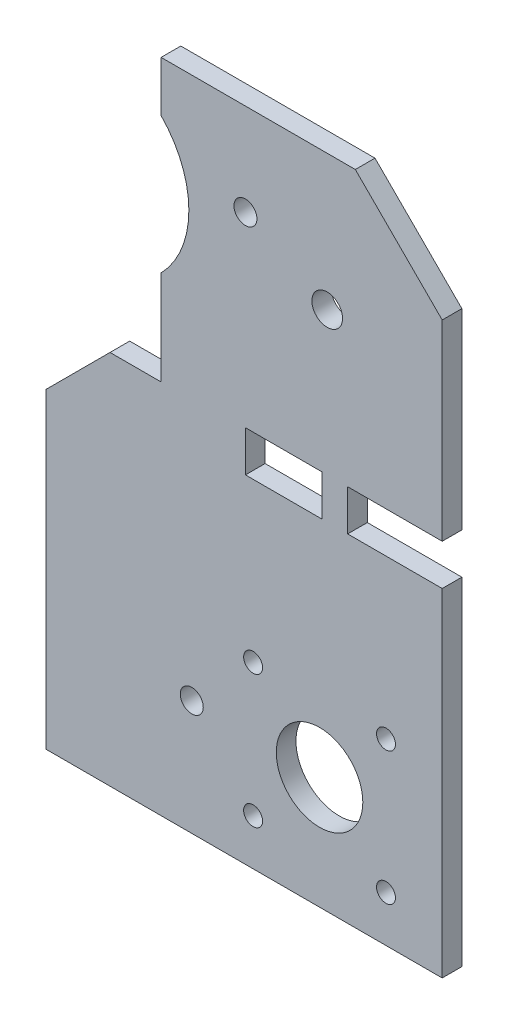
ISO-10303-21;
HEADER;
FILE_DESCRIPTION(('STEP AP214'),'2;1');
FILE_NAME('part.step','',(''),(''),'','','');
FILE_SCHEMA(('AUTOMOTIVE_DESIGN { 1 0 10303 214 1 1 1 1 }'));
ENDSEC;
DATA;
#1=APPLICATION_CONTEXT('core data for automotive mechanical design processes');
#2=APPLICATION_PROTOCOL_DEFINITION('international standard','automotive_design',2000,#1);
#3=PRODUCT_CONTEXT('',#1,'mechanical');
#4=PRODUCT('Part','Part','',(#3));
#5=PRODUCT_RELATED_PRODUCT_CATEGORY('part','',(#4));
#6=PRODUCT_DEFINITION_FORMATION('','',#4);
#7=PRODUCT_DEFINITION_CONTEXT('part definition',#1,'design');
#8=PRODUCT_DEFINITION('design','',#6,#7);
#9=PRODUCT_DEFINITION_SHAPE('','',#8);
#10=(LENGTH_UNIT() NAMED_UNIT(*) SI_UNIT(.MILLI.,.METRE.));
#11=(NAMED_UNIT(*) PLANE_ANGLE_UNIT() SI_UNIT($,.RADIAN.));
#12=(NAMED_UNIT(*) SI_UNIT($,.STERADIAN.) SOLID_ANGLE_UNIT());
#13=UNCERTAINTY_MEASURE_WITH_UNIT(LENGTH_MEASURE(1.E-05),#10,'distance_accuracy_value','');
#14=(GEOMETRIC_REPRESENTATION_CONTEXT(3) GLOBAL_UNCERTAINTY_ASSIGNED_CONTEXT((#13)) GLOBAL_UNIT_ASSIGNED_CONTEXT((#10,
#11,#12)) REPRESENTATION_CONTEXT('',''));
#15=CARTESIAN_POINT('',(0.,0.,0.));
#16=DIRECTION('',(0.,0.,1.));
#17=DIRECTION('',(1.,0.,0.));
#18=AXIS2_PLACEMENT_3D('',#15,#16,#17);
#19=CARTESIAN_POINT('',(119.676783004552,-173.737481031866,-2.3));
#20=DIRECTION('',(0.,0.,1.));
#21=DIRECTION('',(1.,0.,0.));
#22=AXIS2_PLACEMENT_3D('',#19,#20,#21);
#23=CYLINDRICAL_SURFACE('',#22,3.70549115413626);
#24=CARTESIAN_POINT('',(119.676783004552,-173.737481031866,7.7));
#25=DIRECTION('',(0.,0.,1.));
#26=DIRECTION('',(1.,0.,0.));
#27=AXIS2_PLACEMENT_3D('',#24,#25,#26);
#28=CIRCLE('',#27,3.70549115413626);
#29=CARTESIAN_POINT('',(123.382274158689,-173.737481031866,7.7));
#30=VERTEX_POINT('',#29);
#31=EDGE_CURVE('E397',#30,#30,#28,.T.);
#32=ORIENTED_EDGE('',*,*,#31,.T.);
#33=EDGE_LOOP('',(#32));
#34=FACE_BOUND('',#33,.T.);
#35=CARTESIAN_POINT('',(119.676783004552,-173.737481031866,0.));
#36=DIRECTION('',(0.,0.,1.));
#37=DIRECTION('',(1.,0.,0.));
#38=AXIS2_PLACEMENT_3D('',#35,#36,#37);
#39=CIRCLE('',#38,3.70549115413626);
#40=CARTESIAN_POINT('',(123.382274158689,-173.737481031866,0.));
#41=VERTEX_POINT('',#40);
#42=EDGE_CURVE('E401',#41,#41,#39,.T.);
#43=ORIENTED_EDGE('',*,*,#42,.F.);
#44=EDGE_LOOP('',(#43));
#45=FACE_BOUND('',#44,.T.);
#46=ADVANCED_FACE('F41',(#34,#45),#23,.F.);
#47=CARTESIAN_POINT('',(119.676783004552,-225.737481031866,-2.3));
#48=DIRECTION('',(0.,0.,1.));
#49=DIRECTION('',(1.,0.,0.));
#50=AXIS2_PLACEMENT_3D('',#47,#48,#49);
#51=CYLINDRICAL_SURFACE('',#50,3.70549115413626);
#52=CARTESIAN_POINT('',(119.676783004552,-225.737481031866,7.7));
#53=DIRECTION('',(0.,0.,1.));
#54=DIRECTION('',(1.,0.,0.));
#55=AXIS2_PLACEMENT_3D('',#52,#53,#54);
#56=CIRCLE('',#55,3.70549115413626);
#57=CARTESIAN_POINT('',(123.382274158689,-225.737481031866,7.7));
#58=VERTEX_POINT('',#57);
#59=EDGE_CURVE('E383',#58,#58,#56,.T.);
#60=ORIENTED_EDGE('',*,*,#59,.T.);
#61=EDGE_LOOP('',(#60));
#62=FACE_BOUND('',#61,.T.);
#63=CARTESIAN_POINT('',(119.676783004552,-225.737481031866,0.));
#64=DIRECTION('',(0.,0.,1.));
#65=DIRECTION('',(1.,0.,0.));
#66=AXIS2_PLACEMENT_3D('',#63,#64,#65);
#67=CIRCLE('',#66,3.70549115413626);
#68=CARTESIAN_POINT('',(123.382274158689,-225.737481031866,0.));
#69=VERTEX_POINT('',#68);
#70=EDGE_CURVE('E393',#69,#69,#67,.T.);
#71=ORIENTED_EDGE('',*,*,#70,.F.);
#72=EDGE_LOOP('',(#71));
#73=FACE_BOUND('',#72,.T.);
#74=ADVANCED_FACE('F434',(#62,#73),#51,.F.);
#75=CARTESIAN_POINT('',(141.676783004552,13.2625189681335,7.7));
#76=DIRECTION('',(-1.,0.,0.));
#77=DIRECTION('',(0.,-1.,0.));
#78=AXIS2_PLACEMENT_3D('',#75,#76,#77);
#79=PLANE('',#78);
#80=DIRECTION('',(0.,1.,0.));
#81=VECTOR('',#80,1.);
#82=CARTESIAN_POINT('',(141.676783004552,13.2625189681335,0.));
#83=LINE('',#82,#81);
#84=CARTESIAN_POINT('',(141.676783004552,-243.737481031866,0.));
#85=VERTEX_POINT('',#84);
#86=CARTESIAN_POINT('',(141.676783004552,-111.737481031866,0.));
#87=VERTEX_POINT('',#86);
#88=EDGE_CURVE('E316',#85,#87,#83,.T.);
#89=ORIENTED_EDGE('',*,*,#88,.T.);
#90=DIRECTION('',(0.,0.,1.));
#91=VECTOR('',#90,1.);
#92=CARTESIAN_POINT('',(141.676783004552,-111.737481031866,-2.3));
#93=LINE('',#92,#91);
#94=CARTESIAN_POINT('',(141.676783004552,-111.737481031866,7.7));
#95=VERTEX_POINT('',#94);
#96=EDGE_CURVE('E272',#87,#95,#93,.T.);
#97=ORIENTED_EDGE('',*,*,#96,.T.);
#98=DIRECTION('',(0.,1.,0.));
#99=VECTOR('',#98,1.);
#100=CARTESIAN_POINT('',(141.676783004552,13.2625189681335,7.7));
#101=LINE('',#100,#99);
#102=CARTESIAN_POINT('',(141.676783004552,-243.737481031866,7.7));
#103=VERTEX_POINT('',#102);
#104=EDGE_CURVE('E299',#103,#95,#101,.T.);
#105=ORIENTED_EDGE('',*,*,#104,.F.);
#106=DIRECTION('',(0.,0.,-1.));
#107=VECTOR('',#106,1.);
#108=CARTESIAN_POINT('',(141.676783004552,-243.737481031866,7.7));
#109=LINE('',#108,#107);
#110=EDGE_CURVE('E307',#103,#85,#109,.T.);
#111=ORIENTED_EDGE('',*,*,#110,.T.);
#112=EDGE_LOOP('',(#89,#97,#105,#111));
#113=FACE_BOUND('',#112,.T.);
#114=ADVANCED_FACE('F439',(#113),#79,.F.);
#115=CARTESIAN_POINT('',(-13.3232169954477,13.2625189681335,7.7));
#116=DIRECTION('',(1.,0.,0.));
#117=DIRECTION('',(0.,1.,0.));
#118=AXIS2_PLACEMENT_3D('',#115,#116,#117);
#119=PLANE('',#118);
#120=DIRECTION('',(0.,-1.,0.));
#121=VECTOR('',#120,1.);
#122=CARTESIAN_POINT('',(-13.3232169954477,13.2625189681335,7.7));
#123=LINE('',#122,#121);
#124=CARTESIAN_POINT('',(-13.3232169954476,-121.737481031866,7.7));
#125=VERTEX_POINT('',#124);
#126=CARTESIAN_POINT('',(-13.3232169954476,-243.737481031866,7.7));
#127=VERTEX_POINT('',#126);
#128=EDGE_CURVE('E291',#125,#127,#123,.T.);
#129=ORIENTED_EDGE('',*,*,#128,.F.);
#130=DIRECTION('',(0.,0.,1.));
#131=VECTOR('',#130,1.);
#132=CARTESIAN_POINT('',(-13.3232169954476,-121.737481031866,-2.3));
#133=LINE('',#132,#131);
#134=CARTESIAN_POINT('',(-13.3232169954476,-121.737481031866,0.));
#135=VERTEX_POINT('',#134);
#136=EDGE_CURVE('E236',#135,#125,#133,.T.);
#137=ORIENTED_EDGE('',*,*,#136,.F.);
#138=DIRECTION('',(0.,-1.,0.));
#139=VECTOR('',#138,1.);
#140=CARTESIAN_POINT('',(-13.3232169954477,13.2625189681335,0.));
#141=LINE('',#140,#139);
#142=CARTESIAN_POINT('',(-13.3232169954476,-243.737481031866,0.));
#143=VERTEX_POINT('',#142);
#144=EDGE_CURVE('E308',#135,#143,#141,.T.);
#145=ORIENTED_EDGE('',*,*,#144,.T.);
#146=DIRECTION('',(0.,0.,-1.));
#147=VECTOR('',#146,1.);
#148=CARTESIAN_POINT('',(-13.3232169954476,-243.737481031866,7.7));
#149=LINE('',#148,#147);
#150=EDGE_CURVE('E326',#127,#143,#149,.T.);
#151=ORIENTED_EDGE('',*,*,#150,.F.);
#152=EDGE_LOOP('',(#129,#137,#145,#151));
#153=FACE_BOUND('',#152,.T.);
#154=ADVANCED_FACE('F469',(#153),#119,.F.);
#155=CARTESIAN_POINT('',(-13.3232169954476,-243.737481031866,7.7));
#156=DIRECTION('',(0.,1.,0.));
#157=DIRECTION('',(0.,0.,1.));
#158=AXIS2_PLACEMENT_3D('',#155,#156,#157);
#159=PLANE('',#158);
#160=DIRECTION('',(1.,0.,0.));
#161=VECTOR('',#160,1.);
#162=CARTESIAN_POINT('',(-13.3232169954476,-243.737481031866,0.));
#163=LINE('',#162,#161);
#164=EDGE_CURVE('E311',#143,#85,#163,.T.);
#165=ORIENTED_EDGE('',*,*,#164,.T.);
#166=ORIENTED_EDGE('',*,*,#110,.F.);
#167=DIRECTION('',(1.,0.,0.));
#168=VECTOR('',#167,1.);
#169=CARTESIAN_POINT('',(-13.3232169954476,-243.737481031866,7.7));
#170=LINE('',#169,#168);
#171=EDGE_CURVE('E294',#127,#103,#170,.T.);
#172=ORIENTED_EDGE('',*,*,#171,.F.);
#173=ORIENTED_EDGE('',*,*,#150,.T.);
#174=EDGE_LOOP('',(#165,#166,#172,#173));
#175=FACE_BOUND('',#174,.T.);
#176=ADVANCED_FACE('F465',(#175),#159,.F.);
#177=CARTESIAN_POINT('',(141.676783004552,-95.7374810318664,7.7));
#178=VERTEX_POINT('',#177);
#179=CARTESIAN_POINT('',(141.676783004552,-20.7374810318666,7.7));
#180=VERTEX_POINT('',#179);
#181=EDGE_CURVE('E298',#178,#180,#101,.T.);
#182=ORIENTED_EDGE('',*,*,#181,.F.);
#183=DIRECTION('',(0.,0.,1.));
#184=VECTOR('',#183,1.);
#185=CARTESIAN_POINT('',(141.676783004552,-95.7374810318664,-2.3));
#186=LINE('',#185,#184);
#187=CARTESIAN_POINT('',(141.676783004552,-95.7374810318664,0.));
#188=VERTEX_POINT('',#187);
#189=EDGE_CURVE('E271',#188,#178,#186,.T.);
#190=ORIENTED_EDGE('',*,*,#189,.F.);
#191=CARTESIAN_POINT('',(141.676783004552,-20.7374810318666,0.));
#192=VERTEX_POINT('',#191);
#193=EDGE_CURVE('E315',#188,#192,#83,.T.);
#194=ORIENTED_EDGE('',*,*,#193,.T.);
#195=DIRECTION('',(0.,0.,1.));
#196=VECTOR('',#195,1.);
#197=CARTESIAN_POINT('',(141.676783004552,-20.7374810318666,7.7));
#198=LINE('',#197,#196);
#199=EDGE_CURVE('E338',#192,#180,#198,.T.);
#200=ORIENTED_EDGE('',*,*,#199,.T.);
#201=EDGE_LOOP('',(#182,#190,#194,#200));
#202=FACE_BOUND('',#201,.T.);
#203=ADVANCED_FACE('F461',(#202),#79,.F.);
#204=CARTESIAN_POINT('',(-13.3232169954477,13.2625189681335,7.7));
#205=DIRECTION('',(0.,-1.,0.));
#206=DIRECTION('',(0.,0.,-1.));
#207=AXIS2_PLACEMENT_3D('',#204,#205,#206);
#208=PLANE('',#207);
#209=DIRECTION('',(-1.,0.,0.));
#210=VECTOR('',#209,1.);
#211=CARTESIAN_POINT('',(-13.3232169954477,13.2625189681335,0.));
#212=LINE('',#211,#210);
#213=CARTESIAN_POINT('',(107.676783004552,13.2625189681335,0.));
#214=VERTEX_POINT('',#213);
#215=CARTESIAN_POINT('',(31.6767830045524,13.2625189681335,0.));
#216=VERTEX_POINT('',#215);
#217=EDGE_CURVE('E295',#214,#216,#212,.T.);
#218=ORIENTED_EDGE('',*,*,#217,.T.);
#219=DIRECTION('',(0.,0.,1.));
#220=VECTOR('',#219,1.);
#221=CARTESIAN_POINT('',(31.6767830045524,13.2625189681335,-2.3));
#222=LINE('',#221,#220);
#223=CARTESIAN_POINT('',(31.6767830045524,13.2625189681335,7.7));
#224=VERTEX_POINT('',#223);
#225=EDGE_CURVE('E237',#216,#224,#222,.T.);
#226=ORIENTED_EDGE('',*,*,#225,.T.);
#227=DIRECTION('',(-1.,0.,0.));
#228=VECTOR('',#227,1.);
#229=CARTESIAN_POINT('',(-13.3232169954477,13.2625189681335,7.7));
#230=LINE('',#229,#228);
#231=CARTESIAN_POINT('',(107.676783004552,13.2625189681335,7.7));
#232=VERTEX_POINT('',#231);
#233=EDGE_CURVE('E303',#232,#224,#230,.T.);
#234=ORIENTED_EDGE('',*,*,#233,.F.);
#235=DIRECTION('',(0.,0.,-1.));
#236=VECTOR('',#235,1.);
#237=CARTESIAN_POINT('',(107.676783004552,13.2625189681335,7.7));
#238=LINE('',#237,#236);
#239=EDGE_CURVE('E330',#232,#214,#238,.T.);
#240=ORIENTED_EDGE('',*,*,#239,.T.);
#241=EDGE_LOOP('',(#218,#226,#234,#240));
#242=FACE_BOUND('',#241,.T.);
#243=ADVANCED_FACE('F455',(#242),#208,.F.);
#244=CARTESIAN_POINT('',(0.,0.,7.7));
#245=DIRECTION('',(0.,0.,1.));
#246=DIRECTION('',(1.,0.,0.));
#247=AXIS2_PLACEMENT_3D('',#244,#245,#246);
#248=PLANE('',#247);
#249=DIRECTION('',(0.,1.,0.));
#250=VECTOR('',#249,1.);
#251=CARTESIAN_POINT('',(94.6767830045524,-95.7374810318664,7.7));
#252=LINE('',#251,#250);
#253=CARTESIAN_POINT('',(94.6767830045524,-111.737481031866,7.7));
#254=VERTEX_POINT('',#253);
#255=CARTESIAN_POINT('',(94.6767830045524,-95.7374810318664,7.7));
#256=VERTEX_POINT('',#255);
#257=EDGE_CURVE('E56',#254,#256,#252,.T.);
#258=ORIENTED_EDGE('',*,*,#257,.F.);
#259=DIRECTION('',(1.,0.,0.));
#260=VECTOR('',#259,1.);
#261=CARTESIAN_POINT('',(94.6767830045524,-111.737481031866,7.7));
#262=LINE('',#261,#260);
#263=CARTESIAN_POINT('',(64.6767830045524,-111.737481031866,7.7));
#264=VERTEX_POINT('',#263);
#265=EDGE_CURVE('E187',#264,#254,#262,.T.);
#266=ORIENTED_EDGE('',*,*,#265,.F.);
#267=DIRECTION('',(0.,-1.,0.));
#268=VECTOR('',#267,1.);
#269=CARTESIAN_POINT('',(64.6767830045524,-95.7374810318664,7.7));
#270=LINE('',#269,#268);
#271=CARTESIAN_POINT('',(64.6767830045524,-95.7374810318664,7.7));
#272=VERTEX_POINT('',#271);
#273=EDGE_CURVE('E169',#272,#264,#270,.T.);
#274=ORIENTED_EDGE('',*,*,#273,.F.);
#275=DIRECTION('',(-1.,0.,0.));
#276=VECTOR('',#275,1.);
#277=CARTESIAN_POINT('',(94.6767830045524,-95.7374810318664,7.7));
#278=LINE('',#277,#276);
#279=EDGE_CURVE('E179',#256,#272,#278,.T.);
#280=ORIENTED_EDGE('',*,*,#279,.F.);
#281=EDGE_LOOP('',(#258,#266,#274,#280));
#282=FACE_BOUND('',#281,.T.);
#283=CARTESIAN_POINT('',(96.6767830045524,-39.7374810318665,7.7));
#284=DIRECTION('',(0.,0.,1.));
#285=DIRECTION('',(1.,0.,0.));
#286=AXIS2_PLACEMENT_3D('',#283,#284,#285);
#287=CIRCLE('',#286,6.);
#288=CARTESIAN_POINT('',(102.676783004552,-39.7374810318665,7.7));
#289=VERTEX_POINT('',#288);
#290=EDGE_CURVE('E197',#289,#289,#287,.T.);
#291=ORIENTED_EDGE('',*,*,#290,.F.);
#292=EDGE_LOOP('',(#291));
#293=FACE_BOUND('',#292,.T.);
#294=CARTESIAN_POINT('',(67.6767830045524,-173.737481031866,7.7));
#295=DIRECTION('',(0.,0.,1.));
#296=DIRECTION('',(1.,0.,0.));
#297=AXIS2_PLACEMENT_3D('',#294,#295,#296);
#298=CIRCLE('',#297,3.70549115413626);
#299=CARTESIAN_POINT('',(71.3822741586886,-173.737481031866,7.7));
#300=VERTEX_POINT('',#299);
#301=EDGE_CURVE('E206',#300,#300,#298,.T.);
#302=ORIENTED_EDGE('',*,*,#301,.F.);
#303=EDGE_LOOP('',(#302));
#304=FACE_BOUND('',#303,.T.);
#305=CARTESIAN_POINT('',(67.6767830045524,-225.737481031866,7.7));
#306=DIRECTION('',(0.,0.,1.));
#307=DIRECTION('',(1.,0.,0.));
#308=AXIS2_PLACEMENT_3D('',#305,#306,#307);
#309=CIRCLE('',#308,3.70549115413626);
#310=CARTESIAN_POINT('',(71.3822741586886,-225.737481031866,7.7));
#311=VERTEX_POINT('',#310);
#312=EDGE_CURVE('E214',#311,#311,#309,.T.);
#313=ORIENTED_EDGE('',*,*,#312,.F.);
#314=EDGE_LOOP('',(#313));
#315=FACE_BOUND('',#314,.T.);
#316=CARTESIAN_POINT('',(93.6767830045524,-199.737481031866,7.7));
#317=DIRECTION('',(0.,0.,1.));
#318=DIRECTION('',(1.,0.,0.));
#319=AXIS2_PLACEMENT_3D('',#316,#317,#318);
#320=CIRCLE('',#319,16.935062279318);
#321=CARTESIAN_POINT('',(110.61184528387,-199.737481031866,7.7));
#322=VERTEX_POINT('',#321);
#323=EDGE_CURVE('E219',#322,#322,#320,.T.);
#324=ORIENTED_EDGE('',*,*,#323,.F.);
#325=EDGE_LOOP('',(#324));
#326=FACE_BOUND('',#325,.T.);
#327=DIRECTION('',(0.,1.,0.));
#328=VECTOR('',#327,1.);
#329=CARTESIAN_POINT('',(31.6767830045524,13.2625189681335,7.7));
#330=LINE('',#329,#328);
#331=CARTESIAN_POINT('',(31.6767830045524,-6.4748549162759,7.7));
#332=VERTEX_POINT('',#331);
#333=EDGE_CURVE('E232',#332,#224,#330,.T.);
#334=ORIENTED_EDGE('',*,*,#333,.F.);
#335=CARTESIAN_POINT('',(4.42911729558537,-33.1193503246207,7.7));
#336=DIRECTION('',(0.,0.,1.));
#337=DIRECTION('',(1.,0.,0.));
#338=AXIS2_PLACEMENT_3D('',#335,#336,#337);
#339=CIRCLE('',#338,38.1098992671579);
#340=CARTESIAN_POINT('',(31.6767830045524,-59.7638457329655,7.7));
#341=VERTEX_POINT('',#340);
#342=EDGE_CURVE('E254',#341,#332,#339,.T.);
#343=ORIENTED_EDGE('',*,*,#342,.F.);
#344=CARTESIAN_POINT('',(31.6767830045524,-96.7374810318665,7.7));
#345=VERTEX_POINT('',#344);
#346=EDGE_CURVE('E233',#345,#341,#330,.T.);
#347=ORIENTED_EDGE('',*,*,#346,.F.);
#348=DIRECTION('',(1.,0.,0.));
#349=VECTOR('',#348,1.);
#350=CARTESIAN_POINT('',(31.6767830045524,-96.7374810318665,7.7));
#351=LINE('',#350,#349);
#352=CARTESIAN_POINT('',(11.6767830045524,-96.7374810318665,7.7));
#353=VERTEX_POINT('',#352);
#354=EDGE_CURVE('E228',#353,#345,#351,.T.);
#355=ORIENTED_EDGE('',*,*,#354,.F.);
#356=DIRECTION('',(0.707106781186548,0.707106781186547,0.));
#357=VECTOR('',#356,1.);
#358=CARTESIAN_POINT('',(11.6767830045524,-96.7374810318665,7.7));
#359=LINE('',#358,#357);
#360=EDGE_CURVE('E224',#125,#353,#359,.T.);
#361=ORIENTED_EDGE('',*,*,#360,.F.);
#362=ORIENTED_EDGE('',*,*,#128,.T.);
#363=ORIENTED_EDGE('',*,*,#171,.T.);
#364=ORIENTED_EDGE('',*,*,#104,.T.);
#365=DIRECTION('',(1.,0.,0.));
#366=VECTOR('',#365,1.);
#367=CARTESIAN_POINT('',(141.676783004552,-111.737481031866,7.7));
#368=LINE('',#367,#366);
#369=CARTESIAN_POINT('',(104.676783004552,-111.737481031866,7.7));
#370=VERTEX_POINT('',#369);
#371=EDGE_CURVE('E268',#370,#95,#368,.T.);
#372=ORIENTED_EDGE('',*,*,#371,.F.);
#373=DIRECTION('',(0.,-1.,0.));
#374=VECTOR('',#373,1.);
#375=CARTESIAN_POINT('',(104.676783004552,-95.7374810318665,7.7));
#376=LINE('',#375,#374);
#377=CARTESIAN_POINT('',(104.676783004552,-95.7374810318665,7.7));
#378=VERTEX_POINT('',#377);
#379=EDGE_CURVE('E263',#378,#370,#376,.T.);
#380=ORIENTED_EDGE('',*,*,#379,.F.);
#381=DIRECTION('',(-1.,0.,0.));
#382=VECTOR('',#381,1.);
#383=CARTESIAN_POINT('',(141.676783004552,-95.7374810318664,7.7));
#384=LINE('',#383,#382);
#385=EDGE_CURVE('E259',#178,#378,#384,.T.);
#386=ORIENTED_EDGE('',*,*,#385,.F.);
#387=ORIENTED_EDGE('',*,*,#181,.T.);
#388=DIRECTION('',(0.707106781186547,-0.707106781186548,0.));
#389=VECTOR('',#388,1.);
#390=CARTESIAN_POINT('',(60.4696509863431,60.4696509863429,7.7));
#391=LINE('',#390,#389);
#392=EDGE_CURVE('E342',#180,#232,#391,.F.);
#393=ORIENTED_EDGE('',*,*,#392,.T.);
#394=ORIENTED_EDGE('',*,*,#233,.T.);
#395=EDGE_LOOP('',(#334,#343,#347,#355,#361,#362,#363,#364,#372,#380,#386,#387,#393,#394));
#396=FACE_BOUND('',#395,.T.);
#397=CARTESIAN_POINT('',(64.6767830045524,-22.7374810318665,7.7));
#398=DIRECTION('',(0.,0.,1.));
#399=DIRECTION('',(1.,0.,0.));
#400=AXIS2_PLACEMENT_3D('',#397,#398,#399);
#401=CIRCLE('',#400,4.5);
#402=CARTESIAN_POINT('',(69.1767830045524,-22.7374810318665,7.7));
#403=VERTEX_POINT('',#402);
#404=EDGE_CURVE('E264',#403,#403,#401,.T.);
#405=ORIENTED_EDGE('',*,*,#404,.F.);
#406=EDGE_LOOP('',(#405));
#407=FACE_BOUND('',#406,.T.);
#408=CARTESIAN_POINT('',(43.6767830045523,-198.737481031866,7.7));
#409=DIRECTION('',(0.,0.,1.));
#410=DIRECTION('',(1.,0.,0.));
#411=AXIS2_PLACEMENT_3D('',#408,#409,#410);
#412=CIRCLE('',#411,4.5);
#413=CARTESIAN_POINT('',(48.1767830045523,-198.737481031866,7.7));
#414=VERTEX_POINT('',#413);
#415=EDGE_CURVE('E258',#414,#414,#412,.T.);
#416=ORIENTED_EDGE('',*,*,#415,.F.);
#417=EDGE_LOOP('',(#416));
#418=FACE_BOUND('',#417,.T.);
#419=ORIENTED_EDGE('',*,*,#59,.F.);
#420=EDGE_LOOP('',(#419));
#421=FACE_BOUND('',#420,.T.);
#422=ORIENTED_EDGE('',*,*,#31,.F.);
#423=EDGE_LOOP('',(#422));
#424=FACE_BOUND('',#423,.T.);
#425=ADVANCED_FACE('F184',(#282,#293,#304,#315,#326,#396,#407,#418,#421,#424),#248,.T.);
#426=CARTESIAN_POINT('',(0.,0.,0.));
#427=DIRECTION('',(0.,0.,1.));
#428=DIRECTION('',(1.,0.,0.));
#429=AXIS2_PLACEMENT_3D('',#426,#427,#428);
#430=PLANE('',#429);
#431=DIRECTION('',(1.,0.,0.));
#432=VECTOR('',#431,1.);
#433=CARTESIAN_POINT('',(0.,-111.737481031866,0.));
#434=LINE('',#433,#432);
#435=CARTESIAN_POINT('',(64.6767830045524,-111.737481031866,0.));
#436=VERTEX_POINT('',#435);
#437=CARTESIAN_POINT('',(94.6767830045524,-111.737481031866,0.));
#438=VERTEX_POINT('',#437);
#439=EDGE_CURVE('E49',#436,#438,#434,.T.);
#440=ORIENTED_EDGE('',*,*,#439,.T.);
#441=DIRECTION('',(0.,1.,0.));
#442=VECTOR('',#441,1.);
#443=CARTESIAN_POINT('',(94.6767830045524,0.,0.));
#444=LINE('',#443,#442);
#445=CARTESIAN_POINT('',(94.6767830045524,-95.7374810318664,0.));
#446=VERTEX_POINT('',#445);
#447=EDGE_CURVE('E11',#438,#446,#444,.T.);
#448=ORIENTED_EDGE('',*,*,#447,.T.);
#449=DIRECTION('',(-1.,0.,0.));
#450=VECTOR('',#449,1.);
#451=CARTESIAN_POINT('',(0.,-95.7374810318664,0.));
#452=LINE('',#451,#450);
#453=CARTESIAN_POINT('',(64.6767830045524,-95.7374810318664,0.));
#454=VERTEX_POINT('',#453);
#455=EDGE_CURVE('E405',#446,#454,#452,.T.);
#456=ORIENTED_EDGE('',*,*,#455,.T.);
#457=DIRECTION('',(0.,-1.,0.));
#458=VECTOR('',#457,1.);
#459=CARTESIAN_POINT('',(64.6767830045524,0.,0.));
#460=LINE('',#459,#458);
#461=EDGE_CURVE('E172',#454,#436,#460,.T.);
#462=ORIENTED_EDGE('',*,*,#461,.T.);
#463=EDGE_LOOP('',(#440,#448,#456,#462));
#464=FACE_BOUND('',#463,.T.);
#465=CARTESIAN_POINT('',(96.6767830045524,-39.7374810318665,0.));
#466=DIRECTION('',(0.,0.,1.));
#467=DIRECTION('',(1.,0.,0.));
#468=AXIS2_PLACEMENT_3D('',#465,#466,#467);
#469=CIRCLE('',#468,6.);
#470=CARTESIAN_POINT('',(102.676783004552,-39.7374810318665,0.));
#471=VERTEX_POINT('',#470);
#472=EDGE_CURVE('E205',#471,#471,#469,.T.);
#473=ORIENTED_EDGE('',*,*,#472,.T.);
#474=EDGE_LOOP('',(#473));
#475=FACE_BOUND('',#474,.T.);
#476=CARTESIAN_POINT('',(67.6767830045524,-173.737481031866,0.));
#477=DIRECTION('',(0.,0.,1.));
#478=DIRECTION('',(1.,0.,0.));
#479=AXIS2_PLACEMENT_3D('',#476,#477,#478);
#480=CIRCLE('',#479,3.70549115413626);
#481=CARTESIAN_POINT('',(71.3822741586886,-173.737481031866,0.));
#482=VERTEX_POINT('',#481);
#483=EDGE_CURVE('E210',#482,#482,#480,.T.);
#484=ORIENTED_EDGE('',*,*,#483,.T.);
#485=EDGE_LOOP('',(#484));
#486=FACE_BOUND('',#485,.T.);
#487=CARTESIAN_POINT('',(67.6767830045524,-225.737481031866,0.));
#488=DIRECTION('',(0.,0.,1.));
#489=DIRECTION('',(1.,0.,0.));
#490=AXIS2_PLACEMENT_3D('',#487,#488,#489);
#491=CIRCLE('',#490,3.70549115413626);
#492=CARTESIAN_POINT('',(71.3822741586886,-225.737481031866,0.));
#493=VERTEX_POINT('',#492);
#494=EDGE_CURVE('E218',#493,#493,#491,.T.);
#495=ORIENTED_EDGE('',*,*,#494,.T.);
#496=EDGE_LOOP('',(#495));
#497=FACE_BOUND('',#496,.T.);
#498=CARTESIAN_POINT('',(93.6767830045524,-199.737481031866,0.));
#499=DIRECTION('',(0.,0.,1.));
#500=DIRECTION('',(1.,0.,0.));
#501=AXIS2_PLACEMENT_3D('',#498,#499,#500);
#502=CIRCLE('',#501,16.935062279318);
#503=CARTESIAN_POINT('',(110.61184528387,-199.737481031866,0.));
#504=VERTEX_POINT('',#503);
#505=EDGE_CURVE('E223',#504,#504,#502,.T.);
#506=ORIENTED_EDGE('',*,*,#505,.T.);
#507=EDGE_LOOP('',(#506));
#508=FACE_BOUND('',#507,.T.);
#509=CARTESIAN_POINT('',(64.6767830045524,-22.7374810318665,0.));
#510=DIRECTION('',(0.,0.,1.));
#511=DIRECTION('',(1.,0.,0.));
#512=AXIS2_PLACEMENT_3D('',#509,#510,#511);
#513=CIRCLE('',#512,4.5);
#514=CARTESIAN_POINT('',(69.1767830045524,-22.7374810318665,0.));
#515=VERTEX_POINT('',#514);
#516=EDGE_CURVE('E312',#515,#515,#513,.T.);
#517=ORIENTED_EDGE('',*,*,#516,.T.);
#518=EDGE_LOOP('',(#517));
#519=FACE_BOUND('',#518,.T.);
#520=CARTESIAN_POINT('',(43.6767830045523,-198.737481031866,0.));
#521=DIRECTION('',(0.,0.,1.));
#522=DIRECTION('',(1.,0.,0.));
#523=AXIS2_PLACEMENT_3D('',#520,#521,#522);
#524=CIRCLE('',#523,4.5);
#525=CARTESIAN_POINT('',(48.1767830045523,-198.737481031866,0.));
#526=VERTEX_POINT('',#525);
#527=EDGE_CURVE('E276',#526,#526,#524,.T.);
#528=ORIENTED_EDGE('',*,*,#527,.T.);
#529=EDGE_LOOP('',(#528));
#530=FACE_BOUND('',#529,.T.);
#531=CARTESIAN_POINT('',(4.42911729558537,-33.1193503246207,0.));
#532=DIRECTION('',(0.,0.,1.));
#533=DIRECTION('',(1.,0.,0.));
#534=AXIS2_PLACEMENT_3D('',#531,#532,#533);
#535=CIRCLE('',#534,38.1098992671579);
#536=CARTESIAN_POINT('',(31.6767830045524,-59.7638457329655,0.));
#537=VERTEX_POINT('',#536);
#538=CARTESIAN_POINT('',(31.6767830045524,-6.4748549162759,0.));
#539=VERTEX_POINT('',#538);
#540=EDGE_CURVE('E363',#537,#539,#535,.T.);
#541=ORIENTED_EDGE('',*,*,#540,.T.);
#542=DIRECTION('',(0.,1.,0.));
#543=VECTOR('',#542,1.);
#544=CARTESIAN_POINT('',(31.6767830045524,0.,0.));
#545=LINE('',#544,#543);
#546=EDGE_CURVE('E253',#539,#216,#545,.T.);
#547=ORIENTED_EDGE('',*,*,#546,.T.);
#548=ORIENTED_EDGE('',*,*,#217,.F.);
#549=DIRECTION('',(-0.707106781186547,0.707106781186548,0.));
#550=VECTOR('',#549,1.);
#551=CARTESIAN_POINT('',(107.676783004552,13.2625189681335,0.));
#552=LINE('',#551,#550);
#553=EDGE_CURVE('E334',#214,#192,#552,.F.);
#554=ORIENTED_EDGE('',*,*,#553,.T.);
#555=ORIENTED_EDGE('',*,*,#193,.F.);
#556=DIRECTION('',(-1.,0.,0.));
#557=VECTOR('',#556,1.);
#558=CARTESIAN_POINT('',(0.,-95.7374810318665,0.));
#559=LINE('',#558,#557);
#560=CARTESIAN_POINT('',(104.676783004552,-95.7374810318665,0.));
#561=VERTEX_POINT('',#560);
#562=EDGE_CURVE('E345',#188,#561,#559,.T.);
#563=ORIENTED_EDGE('',*,*,#562,.T.);
#564=DIRECTION('',(0.,-1.,0.));
#565=VECTOR('',#564,1.);
#566=CARTESIAN_POINT('',(104.676783004552,0.,0.));
#567=LINE('',#566,#565);
#568=CARTESIAN_POINT('',(104.676783004552,-111.737481031866,0.));
#569=VERTEX_POINT('',#568);
#570=EDGE_CURVE('E355',#561,#569,#567,.T.);
#571=ORIENTED_EDGE('',*,*,#570,.T.);
#572=DIRECTION('',(1.,0.,0.));
#573=VECTOR('',#572,1.);
#574=CARTESIAN_POINT('',(0.,-111.737481031866,0.));
#575=LINE('',#574,#573);
#576=EDGE_CURVE('E359',#569,#87,#575,.T.);
#577=ORIENTED_EDGE('',*,*,#576,.T.);
#578=ORIENTED_EDGE('',*,*,#88,.F.);
#579=ORIENTED_EDGE('',*,*,#164,.F.);
#580=ORIENTED_EDGE('',*,*,#144,.F.);
#581=DIRECTION('',(0.707106781186548,0.707106781186547,0.));
#582=VECTOR('',#581,1.);
#583=CARTESIAN_POINT('',(54.2071320182094,-54.2071320182094,0.));
#584=LINE('',#583,#582);
#585=CARTESIAN_POINT('',(11.6767830045524,-96.7374810318665,0.));
#586=VERTEX_POINT('',#585);
#587=EDGE_CURVE('E375',#135,#586,#584,.T.);
#588=ORIENTED_EDGE('',*,*,#587,.T.);
#589=DIRECTION('',(1.,0.,0.));
#590=VECTOR('',#589,1.);
#591=CARTESIAN_POINT('',(0.,-96.7374810318665,0.));
#592=LINE('',#591,#590);
#593=CARTESIAN_POINT('',(31.6767830045524,-96.7374810318665,0.));
#594=VERTEX_POINT('',#593);
#595=EDGE_CURVE('E379',#586,#594,#592,.T.);
#596=ORIENTED_EDGE('',*,*,#595,.T.);
#597=EDGE_CURVE('E241',#594,#537,#545,.T.);
#598=ORIENTED_EDGE('',*,*,#597,.T.);
#599=EDGE_LOOP('',(#541,#547,#548,#554,#555,#563,#571,#577,#578,#579,#580,#588,#596,#598));
#600=FACE_BOUND('',#599,.T.);
#601=ORIENTED_EDGE('',*,*,#70,.T.);
#602=EDGE_LOOP('',(#601));
#603=FACE_BOUND('',#602,.T.);
#604=ORIENTED_EDGE('',*,*,#42,.T.);
#605=EDGE_LOOP('',(#604));
#606=FACE_BOUND('',#605,.T.);
#607=ADVANCED_FACE('F415',(#464,#475,#486,#497,#508,#519,#530,#600,#603,#606),#430,.F.);
#608=CARTESIAN_POINT('',(107.676783004552,13.2625189681335,7.7));
#609=DIRECTION('',(-0.707106781186548,-0.707106781186547,0.));
#610=DIRECTION('',(0.,0.,-1.));
#611=AXIS2_PLACEMENT_3D('',#608,#609,#610);
#612=PLANE('',#611);
#613=ORIENTED_EDGE('',*,*,#392,.F.);
#614=ORIENTED_EDGE('',*,*,#199,.F.);
#615=ORIENTED_EDGE('',*,*,#553,.F.);
#616=ORIENTED_EDGE('',*,*,#239,.F.);
#617=EDGE_LOOP('',(#613,#614,#615,#616));
#618=FACE_BOUND('',#617,.T.);
#619=ADVANCED_FACE('F446',(#618),#612,.F.);
#620=CARTESIAN_POINT('',(43.6767830045523,-198.737481031866,-2.3));
#621=DIRECTION('',(0.,0.,1.));
#622=DIRECTION('',(1.,0.,0.));
#623=AXIS2_PLACEMENT_3D('',#620,#621,#622);
#624=CYLINDRICAL_SURFACE('',#623,4.5);
#625=ORIENTED_EDGE('',*,*,#415,.T.);
#626=EDGE_LOOP('',(#625));
#627=FACE_BOUND('',#626,.T.);
#628=ORIENTED_EDGE('',*,*,#527,.F.);
#629=EDGE_LOOP('',(#628));
#630=FACE_BOUND('',#629,.T.);
#631=ADVANCED_FACE('F452',(#627,#630),#624,.F.);
#632=CARTESIAN_POINT('',(64.6767830045524,-22.7374810318665,-2.3));
#633=DIRECTION('',(0.,0.,1.));
#634=DIRECTION('',(1.,0.,0.));
#635=AXIS2_PLACEMENT_3D('',#632,#633,#634);
#636=CYLINDRICAL_SURFACE('',#635,4.5);
#637=ORIENTED_EDGE('',*,*,#404,.T.);
#638=EDGE_LOOP('',(#637));
#639=FACE_BOUND('',#638,.T.);
#640=ORIENTED_EDGE('',*,*,#516,.F.);
#641=EDGE_LOOP('',(#640));
#642=FACE_BOUND('',#641,.T.);
#643=ADVANCED_FACE('F548',(#639,#642),#636,.F.);
#644=CARTESIAN_POINT('',(141.676783004552,-111.737481031866,-2.3));
#645=DIRECTION('',(0.,-1.,0.));
#646=DIRECTION('',(0.,0.,-1.));
#647=AXIS2_PLACEMENT_3D('',#644,#645,#646);
#648=PLANE('',#647);
#649=DIRECTION('',(0.,0.,1.));
#650=VECTOR('',#649,1.);
#651=CARTESIAN_POINT('',(104.676783004552,-111.737481031866,-2.3));
#652=LINE('',#651,#650);
#653=EDGE_CURVE('E277',#569,#370,#652,.T.);
#654=ORIENTED_EDGE('',*,*,#653,.T.);
#655=ORIENTED_EDGE('',*,*,#371,.T.);
#656=ORIENTED_EDGE('',*,*,#96,.F.);
#657=ORIENTED_EDGE('',*,*,#576,.F.);
#658=EDGE_LOOP('',(#654,#655,#656,#657));
#659=FACE_BOUND('',#658,.T.);
#660=ADVANCED_FACE('F498',(#659),#648,.F.);
#661=CARTESIAN_POINT('',(104.676783004552,-95.7374810318665,-2.3));
#662=DIRECTION('',(-1.,0.,0.));
#663=DIRECTION('',(0.,0.,1.));
#664=AXIS2_PLACEMENT_3D('',#661,#662,#663);
#665=PLANE('',#664);
#666=DIRECTION('',(0.,0.,1.));
#667=VECTOR('',#666,1.);
#668=CARTESIAN_POINT('',(104.676783004552,-95.7374810318665,-2.3));
#669=LINE('',#668,#667);
#670=EDGE_CURVE('E280',#561,#378,#669,.T.);
#671=ORIENTED_EDGE('',*,*,#670,.T.);
#672=ORIENTED_EDGE('',*,*,#379,.T.);
#673=ORIENTED_EDGE('',*,*,#653,.F.);
#674=ORIENTED_EDGE('',*,*,#570,.F.);
#675=EDGE_LOOP('',(#671,#672,#673,#674));
#676=FACE_BOUND('',#675,.T.);
#677=ADVANCED_FACE('F502',(#676),#665,.F.);
#678=CARTESIAN_POINT('',(141.676783004552,-95.7374810318664,-2.3));
#679=DIRECTION('',(0.,1.,0.));
#680=DIRECTION('',(-1.,0.,0.));
#681=AXIS2_PLACEMENT_3D('',#678,#679,#680);
#682=PLANE('',#681);
#683=ORIENTED_EDGE('',*,*,#189,.T.);
#684=ORIENTED_EDGE('',*,*,#385,.T.);
#685=ORIENTED_EDGE('',*,*,#670,.F.);
#686=ORIENTED_EDGE('',*,*,#562,.F.);
#687=EDGE_LOOP('',(#683,#684,#685,#686));
#688=FACE_BOUND('',#687,.T.);
#689=ADVANCED_FACE('F504',(#688),#682,.F.);
#690=CARTESIAN_POINT('',(4.42911729558537,-33.1193503246207,-2.3));
#691=DIRECTION('',(0.,0.,1.));
#692=DIRECTION('',(1.,0.,0.));
#693=AXIS2_PLACEMENT_3D('',#690,#691,#692);
#694=CYLINDRICAL_SURFACE('',#693,38.1098992671579);
#695=ORIENTED_EDGE('',*,*,#342,.T.);
#696=DIRECTION('',(0.,0.,1.));
#697=VECTOR('',#696,1.);
#698=CARTESIAN_POINT('',(31.6767830045524,-6.4748549162759,-2.3));
#699=LINE('',#698,#697);
#700=EDGE_CURVE('E371',#332,#539,#699,.F.);
#701=ORIENTED_EDGE('',*,*,#700,.T.);
#702=ORIENTED_EDGE('',*,*,#540,.F.);
#703=DIRECTION('',(0.,0.,1.));
#704=VECTOR('',#703,1.);
#705=CARTESIAN_POINT('',(31.6767830045524,-59.7638457329655,-2.3));
#706=LINE('',#705,#704);
#707=EDGE_CURVE('E367',#537,#341,#706,.T.);
#708=ORIENTED_EDGE('',*,*,#707,.T.);
#709=EDGE_LOOP('',(#695,#701,#702,#708));
#710=FACE_BOUND('',#709,.T.);
#711=ADVANCED_FACE('F525',(#710),#694,.F.);
#712=CARTESIAN_POINT('',(31.6767830045524,13.2625189681335,-2.3));
#713=DIRECTION('',(1.,0.,0.));
#714=DIRECTION('',(0.,1.,0.));
#715=AXIS2_PLACEMENT_3D('',#712,#713,#714);
#716=PLANE('',#715);
#717=DIRECTION('',(0.,0.,1.));
#718=VECTOR('',#717,1.);
#719=CARTESIAN_POINT('',(31.6767830045524,-96.7374810318665,-2.3));
#720=LINE('',#719,#718);
#721=EDGE_CURVE('E242',#594,#345,#720,.T.);
#722=ORIENTED_EDGE('',*,*,#721,.T.);
#723=ORIENTED_EDGE('',*,*,#346,.T.);
#724=ORIENTED_EDGE('',*,*,#707,.F.);
#725=ORIENTED_EDGE('',*,*,#597,.F.);
#726=EDGE_LOOP('',(#722,#723,#724,#725));
#727=FACE_BOUND('',#726,.T.);
#728=ADVANCED_FACE('F528',(#727),#716,.F.);
#729=CARTESIAN_POINT('',(11.6767830045524,-96.7374810318665,-2.3));
#730=DIRECTION('',(0.707106781186547,-0.707106781186548,0.));
#731=DIRECTION('',(0.707106781186548,0.707106781186547,0.));
#732=AXIS2_PLACEMENT_3D('',#729,#730,#731);
#733=PLANE('',#732);
#734=ORIENTED_EDGE('',*,*,#136,.T.);
#735=ORIENTED_EDGE('',*,*,#360,.T.);
#736=DIRECTION('',(0.,0.,1.));
#737=VECTOR('',#736,1.);
#738=CARTESIAN_POINT('',(11.6767830045524,-96.7374810318665,-2.3));
#739=LINE('',#738,#737);
#740=EDGE_CURVE('E245',#586,#353,#739,.T.);
#741=ORIENTED_EDGE('',*,*,#740,.F.);
#742=ORIENTED_EDGE('',*,*,#587,.F.);
#743=EDGE_LOOP('',(#734,#735,#741,#742));
#744=FACE_BOUND('',#743,.T.);
#745=ADVANCED_FACE('F534',(#744),#733,.F.);
#746=CARTESIAN_POINT('',(31.6767830045524,-96.7374810318665,-2.3));
#747=DIRECTION('',(0.,-1.,0.));
#748=DIRECTION('',(0.,0.,-1.));
#749=AXIS2_PLACEMENT_3D('',#746,#747,#748);
#750=PLANE('',#749);
#751=ORIENTED_EDGE('',*,*,#740,.T.);
#752=ORIENTED_EDGE('',*,*,#354,.T.);
#753=ORIENTED_EDGE('',*,*,#721,.F.);
#754=ORIENTED_EDGE('',*,*,#595,.F.);
#755=EDGE_LOOP('',(#751,#752,#753,#754));
#756=FACE_BOUND('',#755,.T.);
#757=ADVANCED_FACE('F531',(#756),#750,.F.);
#758=ORIENTED_EDGE('',*,*,#700,.F.);
#759=ORIENTED_EDGE('',*,*,#333,.T.);
#760=ORIENTED_EDGE('',*,*,#225,.F.);
#761=ORIENTED_EDGE('',*,*,#546,.F.);
#762=EDGE_LOOP('',(#758,#759,#760,#761));
#763=FACE_BOUND('',#762,.T.);
#764=ADVANCED_FACE('F516',(#763),#716,.F.);
#765=CARTESIAN_POINT('',(93.6767830045524,-199.737481031866,-2.3));
#766=DIRECTION('',(0.,0.,1.));
#767=DIRECTION('',(1.,0.,0.));
#768=AXIS2_PLACEMENT_3D('',#765,#766,#767);
#769=CYLINDRICAL_SURFACE('',#768,16.935062279318);
#770=ORIENTED_EDGE('',*,*,#323,.T.);
#771=EDGE_LOOP('',(#770));
#772=FACE_BOUND('',#771,.T.);
#773=ORIENTED_EDGE('',*,*,#505,.F.);
#774=EDGE_LOOP('',(#773));
#775=FACE_BOUND('',#774,.T.);
#776=ADVANCED_FACE('F616',(#772,#775),#769,.F.);
#777=CARTESIAN_POINT('',(67.6767830045524,-225.737481031866,-2.3));
#778=DIRECTION('',(0.,0.,1.));
#779=DIRECTION('',(1.,0.,0.));
#780=AXIS2_PLACEMENT_3D('',#777,#778,#779);
#781=CYLINDRICAL_SURFACE('',#780,3.70549115413626);
#782=ORIENTED_EDGE('',*,*,#312,.T.);
#783=EDGE_LOOP('',(#782));
#784=FACE_BOUND('',#783,.T.);
#785=ORIENTED_EDGE('',*,*,#494,.F.);
#786=EDGE_LOOP('',(#785));
#787=FACE_BOUND('',#786,.T.);
#788=ADVANCED_FACE('F624',(#784,#787),#781,.F.);
#789=CARTESIAN_POINT('',(67.6767830045524,-173.737481031866,-2.3));
#790=DIRECTION('',(0.,0.,1.));
#791=DIRECTION('',(1.,0.,0.));
#792=AXIS2_PLACEMENT_3D('',#789,#790,#791);
#793=CYLINDRICAL_SURFACE('',#792,3.70549115413626);
#794=ORIENTED_EDGE('',*,*,#301,.T.);
#795=EDGE_LOOP('',(#794));
#796=FACE_BOUND('',#795,.T.);
#797=ORIENTED_EDGE('',*,*,#483,.F.);
#798=EDGE_LOOP('',(#797));
#799=FACE_BOUND('',#798,.T.);
#800=ADVANCED_FACE('F429',(#796,#799),#793,.F.);
#801=CARTESIAN_POINT('',(96.6767830045524,-39.7374810318665,-2.3));
#802=DIRECTION('',(0.,0.,1.));
#803=DIRECTION('',(1.,0.,0.));
#804=AXIS2_PLACEMENT_3D('',#801,#802,#803);
#805=CYLINDRICAL_SURFACE('',#804,6.);
#806=ORIENTED_EDGE('',*,*,#290,.T.);
#807=EDGE_LOOP('',(#806));
#808=FACE_BOUND('',#807,.T.);
#809=ORIENTED_EDGE('',*,*,#472,.F.);
#810=EDGE_LOOP('',(#809));
#811=FACE_BOUND('',#810,.T.);
#812=ADVANCED_FACE('F422',(#808,#811),#805,.F.);
#813=CARTESIAN_POINT('',(94.6767830045524,-95.7374810318664,-2.3));
#814=DIRECTION('',(1.,0.,0.));
#815=DIRECTION('',(0.,0.,-1.));
#816=AXIS2_PLACEMENT_3D('',#813,#814,#815);
#817=PLANE('',#816);
#818=DIRECTION('',(0.,0.,1.));
#819=VECTOR('',#818,1.);
#820=CARTESIAN_POINT('',(94.6767830045524,-111.737481031866,-2.3));
#821=LINE('',#820,#819);
#822=EDGE_CURVE('E194',#438,#254,#821,.T.);
#823=ORIENTED_EDGE('',*,*,#822,.T.);
#824=ORIENTED_EDGE('',*,*,#257,.T.);
#825=DIRECTION('',(0.,0.,1.));
#826=VECTOR('',#825,1.);
#827=CARTESIAN_POINT('',(94.6767830045524,-95.7374810318664,-2.3));
#828=LINE('',#827,#826);
#829=EDGE_CURVE('E176',#446,#256,#828,.T.);
#830=ORIENTED_EDGE('',*,*,#829,.F.);
#831=ORIENTED_EDGE('',*,*,#447,.F.);
#832=EDGE_LOOP('',(#823,#824,#830,#831));
#833=FACE_BOUND('',#832,.T.);
#834=ADVANCED_FACE('F420',(#833),#817,.F.);
#835=CARTESIAN_POINT('',(94.6767830045524,-111.737481031866,-2.3));
#836=DIRECTION('',(0.,-1.,0.));
#837=DIRECTION('',(0.,0.,-1.));
#838=AXIS2_PLACEMENT_3D('',#835,#836,#837);
#839=PLANE('',#838);
#840=DIRECTION('',(0.,0.,1.));
#841=VECTOR('',#840,1.);
#842=CARTESIAN_POINT('',(64.6767830045524,-111.737481031866,-2.3));
#843=LINE('',#842,#841);
#844=EDGE_CURVE('E175',#436,#264,#843,.T.);
#845=ORIENTED_EDGE('',*,*,#844,.T.);
#846=ORIENTED_EDGE('',*,*,#265,.T.);
#847=ORIENTED_EDGE('',*,*,#822,.F.);
#848=ORIENTED_EDGE('',*,*,#439,.F.);
#849=EDGE_LOOP('',(#845,#846,#847,#848));
#850=FACE_BOUND('',#849,.T.);
#851=ADVANCED_FACE('F419',(#850),#839,.F.);
#852=CARTESIAN_POINT('',(64.6767830045524,-95.7374810318664,-2.3));
#853=DIRECTION('',(-1.,0.,0.));
#854=DIRECTION('',(0.,0.,1.));
#855=AXIS2_PLACEMENT_3D('',#852,#853,#854);
#856=PLANE('',#855);
#857=DIRECTION('',(0.,0.,1.));
#858=VECTOR('',#857,1.);
#859=CARTESIAN_POINT('',(64.6767830045524,-95.7374810318664,-2.3));
#860=LINE('',#859,#858);
#861=EDGE_CURVE('E64',#454,#272,#860,.T.);
#862=ORIENTED_EDGE('',*,*,#861,.T.);
#863=ORIENTED_EDGE('',*,*,#273,.T.);
#864=ORIENTED_EDGE('',*,*,#844,.F.);
#865=ORIENTED_EDGE('',*,*,#461,.F.);
#866=EDGE_LOOP('',(#862,#863,#864,#865));
#867=FACE_BOUND('',#866,.T.);
#868=ADVANCED_FACE('F166',(#867),#856,.F.);
#869=CARTESIAN_POINT('',(94.6767830045524,-95.7374810318664,-2.3));
#870=DIRECTION('',(0.,1.,0.));
#871=DIRECTION('',(0.,0.,1.));
#872=AXIS2_PLACEMENT_3D('',#869,#870,#871);
#873=PLANE('',#872);
#874=ORIENTED_EDGE('',*,*,#829,.T.);
#875=ORIENTED_EDGE('',*,*,#279,.T.);
#876=ORIENTED_EDGE('',*,*,#861,.F.);
#877=ORIENTED_EDGE('',*,*,#455,.F.);
#878=EDGE_LOOP('',(#874,#875,#876,#877));
#879=FACE_BOUND('',#878,.T.);
#880=ADVANCED_FACE('F180',(#879),#873,.F.);
#881=CLOSED_SHELL('',(#46,#74,#114,#154,#176,#203,#243,#425,#607,#619,#631,#643,#660,#677,#689,
#711,#728,#745,#757,#764,#776,#788,#800,#812,#834,#851,#868,#880));
#882=MANIFOLD_SOLID_BREP('B2',#881);
#883=ADVANCED_BREP_SHAPE_REPRESENTATION('',(#18,#882),#14);
#884=SHAPE_DEFINITION_REPRESENTATION(#9,#883);
ENDSEC;
END-ISO-10303-21;
